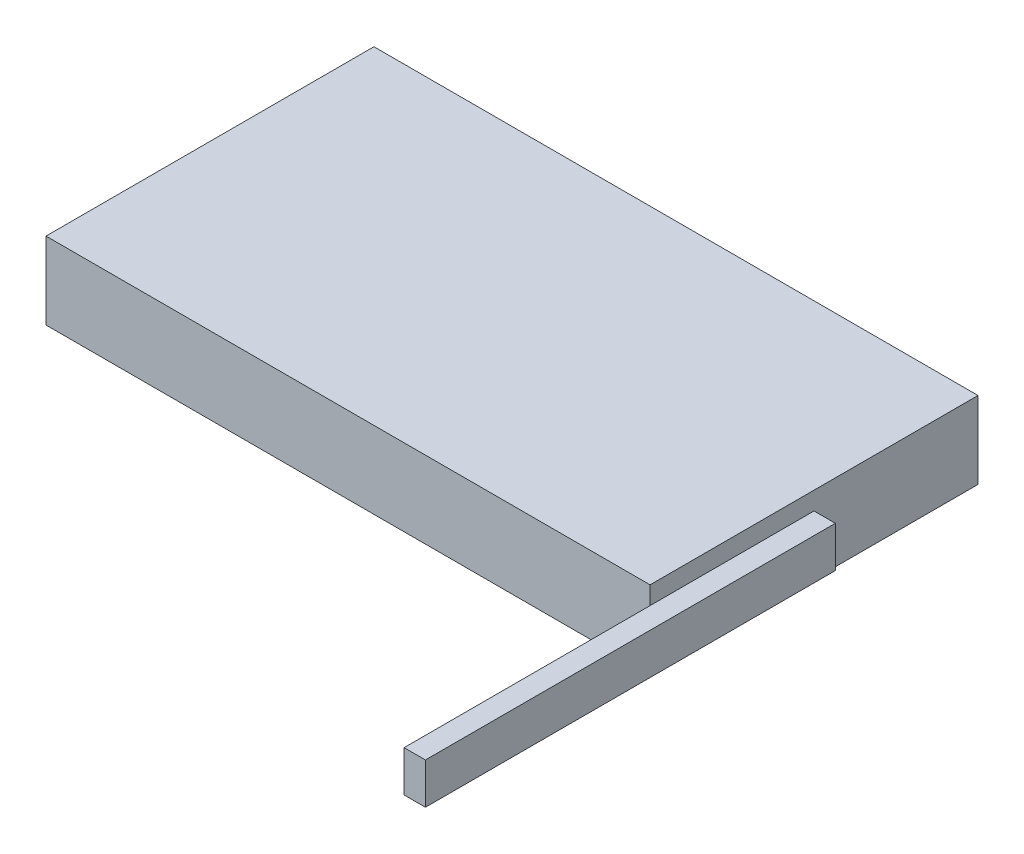
ISO-10303-21;
HEADER;
FILE_DESCRIPTION(('STEP AP214'),'2;1');
FILE_NAME('part.step','',(''),(''),'','','');
FILE_SCHEMA(('AUTOMOTIVE_DESIGN { 1 0 10303 214 1 1 1 1 }'));
ENDSEC;
DATA;
#1=APPLICATION_CONTEXT('core data for automotive mechanical design processes');
#2=APPLICATION_PROTOCOL_DEFINITION('international standard','automotive_design',2000,#1);
#3=PRODUCT_CONTEXT('',#1,'mechanical');
#4=PRODUCT('Part','Part','',(#3));
#5=PRODUCT_RELATED_PRODUCT_CATEGORY('part','',(#4));
#6=PRODUCT_DEFINITION_FORMATION('','',#4);
#7=PRODUCT_DEFINITION_CONTEXT('part definition',#1,'design');
#8=PRODUCT_DEFINITION('design','',#6,#7);
#9=PRODUCT_DEFINITION_SHAPE('','',#8);
#10=(LENGTH_UNIT() NAMED_UNIT(*) SI_UNIT(.MILLI.,.METRE.));
#11=(NAMED_UNIT(*) PLANE_ANGLE_UNIT() SI_UNIT($,.RADIAN.));
#12=(NAMED_UNIT(*) SI_UNIT($,.STERADIAN.) SOLID_ANGLE_UNIT());
#13=UNCERTAINTY_MEASURE_WITH_UNIT(LENGTH_MEASURE(1.E-05),#10,'distance_accuracy_value','');
#14=(GEOMETRIC_REPRESENTATION_CONTEXT(3) GLOBAL_UNCERTAINTY_ASSIGNED_CONTEXT((#13)) GLOBAL_UNIT_ASSIGNED_CONTEXT((#10,
#11,#12)) REPRESENTATION_CONTEXT('',''));
#15=CARTESIAN_POINT('',(0.,0.,0.));
#16=DIRECTION('',(0.,0.,1.));
#17=DIRECTION('',(1.,0.,0.));
#18=AXIS2_PLACEMENT_3D('',#15,#16,#17);
#19=CARTESIAN_POINT('',(0.,4.7,0.));
#20=DIRECTION('',(1.,0.,0.));
#21=DIRECTION('',(0.,0.,-1.));
#22=AXIS2_PLACEMENT_3D('',#19,#20,#21);
#23=PLANE('',#22);
#24=DIRECTION('',(0.,0.,1.));
#25=VECTOR('',#24,1.);
#26=CARTESIAN_POINT('',(0.,0.,0.));
#27=LINE('',#26,#25);
#28=CARTESIAN_POINT('',(0.,0.,0.));
#29=VERTEX_POINT('',#28);
#30=CARTESIAN_POINT('',(0.,0.,20.));
#31=VERTEX_POINT('',#30);
#32=EDGE_CURVE('E154',#29,#31,#27,.T.);
#33=ORIENTED_EDGE('',*,*,#32,.T.);
#34=DIRECTION('',(0.,-1.,0.));
#35=VECTOR('',#34,1.);
#36=CARTESIAN_POINT('',(0.,4.7,20.));
#37=LINE('',#36,#35);
#38=CARTESIAN_POINT('',(0.,4.7,20.));
#39=VERTEX_POINT('',#38);
#40=EDGE_CURVE('E11',#39,#31,#37,.T.);
#41=ORIENTED_EDGE('',*,*,#40,.F.);
#42=DIRECTION('',(0.,0.,1.));
#43=VECTOR('',#42,1.);
#44=CARTESIAN_POINT('',(0.,4.7,0.));
#45=LINE('',#44,#43);
#46=CARTESIAN_POINT('',(0.,4.7,0.));
#47=VERTEX_POINT('',#46);
#48=EDGE_CURVE('E159',#47,#39,#45,.T.);
#49=ORIENTED_EDGE('',*,*,#48,.F.);
#50=DIRECTION('',(0.,-1.,0.));
#51=VECTOR('',#50,1.);
#52=CARTESIAN_POINT('',(0.,4.7,0.));
#53=LINE('',#52,#51);
#54=EDGE_CURVE('E165',#47,#29,#53,.T.);
#55=ORIENTED_EDGE('',*,*,#54,.T.);
#56=EDGE_LOOP('',(#33,#41,#49,#55));
#57=FACE_BOUND('',#56,.T.);
#58=ADVANCED_FACE('F33',(#57),#23,.F.);
#59=CARTESIAN_POINT('',(0.,4.7,20.));
#60=DIRECTION('',(0.,0.,-1.));
#61=DIRECTION('',(-1.,0.,0.));
#62=AXIS2_PLACEMENT_3D('',#59,#60,#61);
#63=PLANE('',#62);
#64=DIRECTION('',(1.,0.,0.));
#65=VECTOR('',#64,1.);
#66=CARTESIAN_POINT('',(0.,0.,20.));
#67=LINE('',#66,#65);
#68=CARTESIAN_POINT('',(36.84,0.,20.));
#69=VERTEX_POINT('',#68);
#70=EDGE_CURVE('E168',#31,#69,#67,.T.);
#71=ORIENTED_EDGE('',*,*,#70,.T.);
#72=DIRECTION('',(0.,-1.,0.));
#73=VECTOR('',#72,1.);
#74=CARTESIAN_POINT('',(36.84,4.7,20.));
#75=LINE('',#74,#73);
#76=CARTESIAN_POINT('',(36.84,1.1,20.));
#77=VERTEX_POINT('',#76);
#78=EDGE_CURVE('E176',#77,#69,#75,.T.);
#79=ORIENTED_EDGE('',*,*,#78,.F.);
#80=CARTESIAN_POINT('',(36.84,3.6,20.));
#81=VERTEX_POINT('',#80);
#82=EDGE_CURVE('E119',#81,#77,#75,.T.);
#83=ORIENTED_EDGE('',*,*,#82,.F.);
#84=CARTESIAN_POINT('',(36.84,4.7,20.));
#85=VERTEX_POINT('',#84);
#86=EDGE_CURVE('E40',#85,#81,#75,.T.);
#87=ORIENTED_EDGE('',*,*,#86,.F.);
#88=DIRECTION('',(1.,0.,0.));
#89=VECTOR('',#88,1.);
#90=CARTESIAN_POINT('',(0.,4.7,20.));
#91=LINE('',#90,#89);
#92=EDGE_CURVE('E84',#39,#85,#91,.T.);
#93=ORIENTED_EDGE('',*,*,#92,.F.);
#94=ORIENTED_EDGE('',*,*,#40,.T.);
#95=EDGE_LOOP('',(#71,#79,#83,#87,#93,#94));
#96=FACE_BOUND('',#95,.T.);
#97=ADVANCED_FACE('F185',(#96),#63,.F.);
#98=CARTESIAN_POINT('',(36.84,4.7,0.));
#99=DIRECTION('',(-1.,0.,0.));
#100=DIRECTION('',(0.,0.,1.));
#101=AXIS2_PLACEMENT_3D('',#98,#99,#100);
#102=PLANE('',#101);
#103=DIRECTION('',(0.,-1.,0.));
#104=VECTOR('',#103,1.);
#105=CARTESIAN_POINT('',(36.84,3.6,10.));
#106=LINE('',#105,#104);
#107=CARTESIAN_POINT('',(36.84,3.6,10.));
#108=VERTEX_POINT('',#107);
#109=CARTESIAN_POINT('',(36.84,1.1,10.));
#110=VERTEX_POINT('',#109);
#111=EDGE_CURVE('E142',#108,#110,#106,.T.);
#112=ORIENTED_EDGE('',*,*,#111,.T.);
#113=DIRECTION('',(0.,0.,1.));
#114=VECTOR('',#113,1.);
#115=CARTESIAN_POINT('',(36.84,1.1,10.));
#116=LINE('',#115,#114);
#117=EDGE_CURVE('E122',#110,#77,#116,.T.);
#118=ORIENTED_EDGE('',*,*,#117,.T.);
#119=ORIENTED_EDGE('',*,*,#78,.T.);
#120=DIRECTION('',(0.,0.,-1.));
#121=VECTOR('',#120,1.);
#122=CARTESIAN_POINT('',(36.84,0.,0.));
#123=LINE('',#122,#121);
#124=CARTESIAN_POINT('',(36.84,0.,0.));
#125=VERTEX_POINT('',#124);
#126=EDGE_CURVE('E171',#69,#125,#123,.T.);
#127=ORIENTED_EDGE('',*,*,#126,.T.);
#128=DIRECTION('',(0.,-1.,0.));
#129=VECTOR('',#128,1.);
#130=CARTESIAN_POINT('',(36.84,4.7,0.));
#131=LINE('',#130,#129);
#132=CARTESIAN_POINT('',(36.84,4.7,0.));
#133=VERTEX_POINT('',#132);
#134=EDGE_CURVE('E175',#133,#125,#131,.T.);
#135=ORIENTED_EDGE('',*,*,#134,.F.);
#136=DIRECTION('',(0.,0.,-1.));
#137=VECTOR('',#136,1.);
#138=CARTESIAN_POINT('',(36.84,4.7,0.));
#139=LINE('',#138,#137);
#140=EDGE_CURVE('E162',#85,#133,#139,.T.);
#141=ORIENTED_EDGE('',*,*,#140,.F.);
#142=ORIENTED_EDGE('',*,*,#86,.T.);
#143=DIRECTION('',(0.,0.,1.));
#144=VECTOR('',#143,1.);
#145=CARTESIAN_POINT('',(36.84,3.6,10.));
#146=LINE('',#145,#144);
#147=EDGE_CURVE('E151',#108,#81,#146,.T.);
#148=ORIENTED_EDGE('',*,*,#147,.F.);
#149=EDGE_LOOP('',(#112,#118,#119,#127,#135,#141,#142,#148));
#150=FACE_BOUND('',#149,.T.);
#151=ADVANCED_FACE('F182',(#150),#102,.F.);
#152=CARTESIAN_POINT('',(0.,4.7,0.));
#153=DIRECTION('',(0.,0.,1.));
#154=DIRECTION('',(1.,0.,0.));
#155=AXIS2_PLACEMENT_3D('',#152,#153,#154);
#156=PLANE('',#155);
#157=DIRECTION('',(-1.,0.,0.));
#158=VECTOR('',#157,1.);
#159=CARTESIAN_POINT('',(0.,0.,0.));
#160=LINE('',#159,#158);
#161=EDGE_CURVE('E77',#125,#29,#160,.T.);
#162=ORIENTED_EDGE('',*,*,#161,.T.);
#163=ORIENTED_EDGE('',*,*,#54,.F.);
#164=DIRECTION('',(-1.,0.,0.));
#165=VECTOR('',#164,1.);
#166=CARTESIAN_POINT('',(0.,4.7,0.));
#167=LINE('',#166,#165);
#168=EDGE_CURVE('E56',#133,#47,#167,.T.);
#169=ORIENTED_EDGE('',*,*,#168,.F.);
#170=ORIENTED_EDGE('',*,*,#134,.T.);
#171=EDGE_LOOP('',(#162,#163,#169,#170));
#172=FACE_BOUND('',#171,.T.);
#173=ADVANCED_FACE('F192',(#172),#156,.F.);
#174=CARTESIAN_POINT('',(0.,4.7,0.));
#175=DIRECTION('',(0.,1.,0.));
#176=DIRECTION('',(0.,0.,1.));
#177=AXIS2_PLACEMENT_3D('',#174,#175,#176);
#178=PLANE('',#177);
#179=ORIENTED_EDGE('',*,*,#48,.T.);
#180=ORIENTED_EDGE('',*,*,#92,.T.);
#181=ORIENTED_EDGE('',*,*,#140,.T.);
#182=ORIENTED_EDGE('',*,*,#168,.T.);
#183=EDGE_LOOP('',(#179,#180,#181,#182));
#184=FACE_BOUND('',#183,.T.);
#185=ADVANCED_FACE('F193',(#184),#178,.T.);
#186=CARTESIAN_POINT('',(0.,0.,0.));
#187=DIRECTION('',(0.,1.,0.));
#188=DIRECTION('',(0.,0.,1.));
#189=AXIS2_PLACEMENT_3D('',#186,#187,#188);
#190=PLANE('',#189);
#191=ORIENTED_EDGE('',*,*,#32,.F.);
#192=ORIENTED_EDGE('',*,*,#161,.F.);
#193=ORIENTED_EDGE('',*,*,#126,.F.);
#194=ORIENTED_EDGE('',*,*,#70,.F.);
#195=EDGE_LOOP('',(#191,#192,#193,#194));
#196=FACE_BOUND('',#195,.T.);
#197=ADVANCED_FACE('F189',(#196),#190,.F.);
#198=CARTESIAN_POINT('',(36.84,3.6,10.));
#199=DIRECTION('',(-1.,0.,0.));
#200=DIRECTION('',(0.,0.,1.));
#201=AXIS2_PLACEMENT_3D('',#198,#199,#200);
#202=PLANE('',#201);
#203=CARTESIAN_POINT('',(36.84,3.6,35.));
#204=VERTEX_POINT('',#203);
#205=EDGE_CURVE('E155',#81,#204,#146,.T.);
#206=ORIENTED_EDGE('',*,*,#205,.F.);
#207=ORIENTED_EDGE('',*,*,#82,.T.);
#208=CARTESIAN_POINT('',(36.84,1.1,35.));
#209=VERTEX_POINT('',#208);
#210=EDGE_CURVE('E113',#77,#209,#116,.T.);
#211=ORIENTED_EDGE('',*,*,#210,.T.);
#212=DIRECTION('',(0.,-1.,0.));
#213=VECTOR('',#212,1.);
#214=CARTESIAN_POINT('',(36.84,3.6,35.));
#215=LINE('',#214,#213);
#216=EDGE_CURVE('E117',#204,#209,#215,.T.);
#217=ORIENTED_EDGE('',*,*,#216,.F.);
#218=EDGE_LOOP('',(#206,#207,#211,#217));
#219=FACE_BOUND('',#218,.T.);
#220=ADVANCED_FACE('F115',(#219),#202,.T.);
#221=CARTESIAN_POINT('',(36.84,3.6,10.));
#222=DIRECTION('',(0.,1.,0.));
#223=DIRECTION('',(0.,0.,1.));
#224=AXIS2_PLACEMENT_3D('',#221,#222,#223);
#225=PLANE('',#224);
#226=ORIENTED_EDGE('',*,*,#147,.T.);
#227=ORIENTED_EDGE('',*,*,#205,.T.);
#228=DIRECTION('',(-1.,0.,0.));
#229=VECTOR('',#228,1.);
#230=CARTESIAN_POINT('',(36.84,3.6,35.));
#231=LINE('',#230,#229);
#232=CARTESIAN_POINT('',(38.14,3.6,35.));
#233=VERTEX_POINT('',#232);
#234=EDGE_CURVE('E137',#233,#204,#231,.T.);
#235=ORIENTED_EDGE('',*,*,#234,.F.);
#236=DIRECTION('',(0.,0.,1.));
#237=VECTOR('',#236,1.);
#238=CARTESIAN_POINT('',(38.14,3.6,10.));
#239=LINE('',#238,#237);
#240=CARTESIAN_POINT('',(38.14,3.6,10.));
#241=VERTEX_POINT('',#240);
#242=EDGE_CURVE('E156',#241,#233,#239,.T.);
#243=ORIENTED_EDGE('',*,*,#242,.F.);
#244=DIRECTION('',(-1.,0.,0.));
#245=VECTOR('',#244,1.);
#246=CARTESIAN_POINT('',(36.84,3.6,10.));
#247=LINE('',#246,#245);
#248=EDGE_CURVE('E123',#241,#108,#247,.T.);
#249=ORIENTED_EDGE('',*,*,#248,.T.);
#250=EDGE_LOOP('',(#226,#227,#235,#243,#249));
#251=FACE_BOUND('',#250,.T.);
#252=ADVANCED_FACE('F246',(#251),#225,.T.);
#253=CARTESIAN_POINT('',(38.14,3.6,10.));
#254=DIRECTION('',(1.,0.,0.));
#255=DIRECTION('',(0.,0.,-1.));
#256=AXIS2_PLACEMENT_3D('',#253,#254,#255);
#257=PLANE('',#256);
#258=ORIENTED_EDGE('',*,*,#242,.T.);
#259=DIRECTION('',(0.,1.,0.));
#260=VECTOR('',#259,1.);
#261=CARTESIAN_POINT('',(38.14,3.6,35.));
#262=LINE('',#261,#260);
#263=CARTESIAN_POINT('',(38.14,1.1,35.));
#264=VERTEX_POINT('',#263);
#265=EDGE_CURVE('E132',#264,#233,#262,.T.);
#266=ORIENTED_EDGE('',*,*,#265,.F.);
#267=DIRECTION('',(0.,0.,1.));
#268=VECTOR('',#267,1.);
#269=CARTESIAN_POINT('',(38.14,1.1,10.));
#270=LINE('',#269,#268);
#271=CARTESIAN_POINT('',(38.14,1.1,10.));
#272=VERTEX_POINT('',#271);
#273=EDGE_CURVE('E128',#272,#264,#270,.T.);
#274=ORIENTED_EDGE('',*,*,#273,.F.);
#275=DIRECTION('',(0.,1.,0.));
#276=VECTOR('',#275,1.);
#277=CARTESIAN_POINT('',(38.14,3.6,10.));
#278=LINE('',#277,#276);
#279=EDGE_CURVE('E146',#272,#241,#278,.T.);
#280=ORIENTED_EDGE('',*,*,#279,.T.);
#281=EDGE_LOOP('',(#258,#266,#274,#280));
#282=FACE_BOUND('',#281,.T.);
#283=ADVANCED_FACE('F251',(#282),#257,.T.);
#284=CARTESIAN_POINT('',(36.84,1.1,10.));
#285=DIRECTION('',(0.,-1.,0.));
#286=DIRECTION('',(0.,0.,-1.));
#287=AXIS2_PLACEMENT_3D('',#284,#285,#286);
#288=PLANE('',#287);
#289=ORIENTED_EDGE('',*,*,#273,.T.);
#290=DIRECTION('',(1.,0.,0.));
#291=VECTOR('',#290,1.);
#292=CARTESIAN_POINT('',(36.84,1.1,35.));
#293=LINE('',#292,#291);
#294=EDGE_CURVE('E126',#209,#264,#293,.T.);
#295=ORIENTED_EDGE('',*,*,#294,.F.);
#296=ORIENTED_EDGE('',*,*,#210,.F.);
#297=ORIENTED_EDGE('',*,*,#117,.F.);
#298=DIRECTION('',(1.,0.,0.));
#299=VECTOR('',#298,1.);
#300=CARTESIAN_POINT('',(36.84,1.1,10.));
#301=LINE('',#300,#299);
#302=EDGE_CURVE('E47',#110,#272,#301,.T.);
#303=ORIENTED_EDGE('',*,*,#302,.T.);
#304=EDGE_LOOP('',(#289,#295,#296,#297,#303));
#305=FACE_BOUND('',#304,.T.);
#306=ADVANCED_FACE('F127',(#305),#288,.T.);
#307=CARTESIAN_POINT('',(0.,0.,10.));
#308=DIRECTION('',(0.,0.,1.));
#309=DIRECTION('',(1.,0.,0.));
#310=AXIS2_PLACEMENT_3D('',#307,#308,#309);
#311=PLANE('',#310);
#312=ORIENTED_EDGE('',*,*,#111,.F.);
#313=ORIENTED_EDGE('',*,*,#248,.F.);
#314=ORIENTED_EDGE('',*,*,#279,.F.);
#315=ORIENTED_EDGE('',*,*,#302,.F.);
#316=EDGE_LOOP('',(#312,#313,#314,#315));
#317=FACE_BOUND('',#316,.T.);
#318=ADVANCED_FACE('F266',(#317),#311,.F.);
#319=CARTESIAN_POINT('',(0.,0.,35.));
#320=DIRECTION('',(0.,0.,1.));
#321=DIRECTION('',(1.,0.,0.));
#322=AXIS2_PLACEMENT_3D('',#319,#320,#321);
#323=PLANE('',#322);
#324=ORIENTED_EDGE('',*,*,#216,.T.);
#325=ORIENTED_EDGE('',*,*,#294,.T.);
#326=ORIENTED_EDGE('',*,*,#265,.T.);
#327=ORIENTED_EDGE('',*,*,#234,.T.);
#328=EDGE_LOOP('',(#324,#325,#326,#327));
#329=FACE_BOUND('',#328,.T.);
#330=ADVANCED_FACE('F135',(#329),#323,.T.);
#331=CLOSED_SHELL('',(#58,#97,#151,#173,#185,#197,#220,#252,#283,#306,#318,#330));
#332=MANIFOLD_SOLID_BREP('B2',#331);
#333=ADVANCED_BREP_SHAPE_REPRESENTATION('',(#18,#332),#14);
#334=SHAPE_DEFINITION_REPRESENTATION(#9,#333);
ENDSEC;
END-ISO-10303-21;
